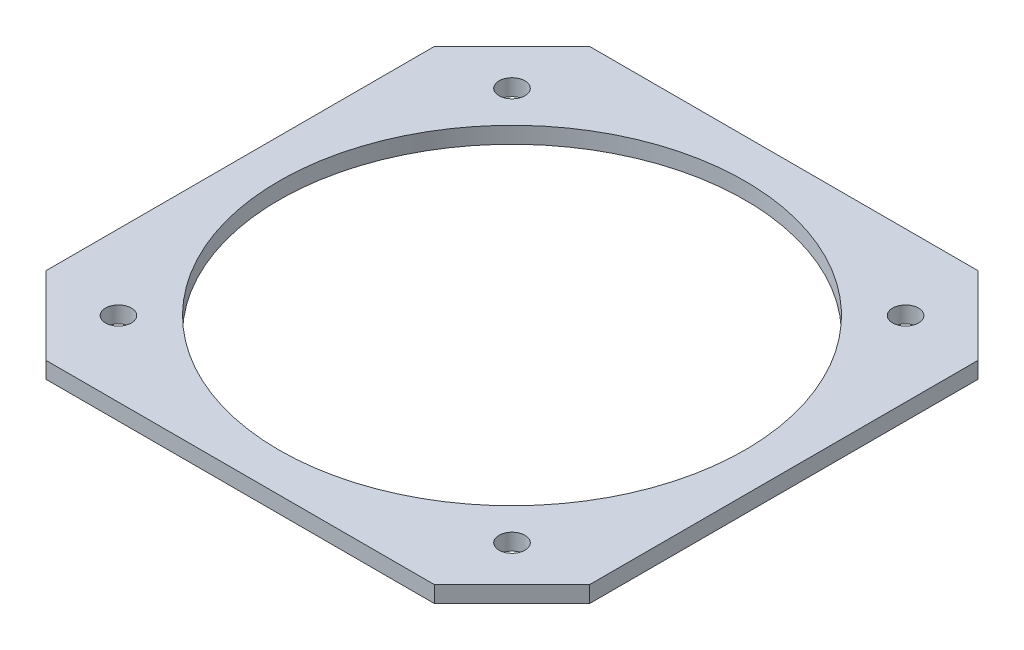
ISO-10303-21;
HEADER;
FILE_DESCRIPTION(('STEP AP214'),'2;1');
FILE_NAME('part.step','',(''),(''),'','','');
FILE_SCHEMA(('AUTOMOTIVE_DESIGN { 1 0 10303 214 1 1 1 1 }'));
ENDSEC;
DATA;
#1=APPLICATION_CONTEXT('core data for automotive mechanical design processes');
#2=APPLICATION_PROTOCOL_DEFINITION('international standard','automotive_design',2000,#1);
#3=PRODUCT_CONTEXT('',#1,'mechanical');
#4=PRODUCT('Part','Part','',(#3));
#5=PRODUCT_RELATED_PRODUCT_CATEGORY('part','',(#4));
#6=PRODUCT_DEFINITION_FORMATION('','',#4);
#7=PRODUCT_DEFINITION_CONTEXT('part definition',#1,'design');
#8=PRODUCT_DEFINITION('design','',#6,#7);
#9=PRODUCT_DEFINITION_SHAPE('','',#8);
#10=(LENGTH_UNIT() NAMED_UNIT(*) SI_UNIT(.MILLI.,.METRE.));
#11=(NAMED_UNIT(*) PLANE_ANGLE_UNIT() SI_UNIT($,.RADIAN.));
#12=(NAMED_UNIT(*) SI_UNIT($,.STERADIAN.) SOLID_ANGLE_UNIT());
#13=UNCERTAINTY_MEASURE_WITH_UNIT(LENGTH_MEASURE(1.E-05),#10,'distance_accuracy_value','');
#14=(GEOMETRIC_REPRESENTATION_CONTEXT(3) GLOBAL_UNCERTAINTY_ASSIGNED_CONTEXT((#13)) GLOBAL_UNIT_ASSIGNED_CONTEXT((#10,
#11,#12)) REPRESENTATION_CONTEXT('',''));
#15=CARTESIAN_POINT('',(0.,0.,0.));
#16=DIRECTION('',(0.,0.,1.));
#17=DIRECTION('',(1.,0.,0.));
#18=AXIS2_PLACEMENT_3D('',#15,#16,#17);
#19=CARTESIAN_POINT('',(0.,6.35,0.));
#20=DIRECTION('',(0.,1.,0.));
#21=DIRECTION('',(0.,0.,1.));
#22=AXIS2_PLACEMENT_3D('',#19,#20,#21);
#23=PLANE('',#22);
#24=CARTESIAN_POINT('',(76.0139789775539,6.35,76.0139789775538));
#25=DIRECTION('',(0.,1.,0.));
#26=DIRECTION('',(0.,0.,1.));
#27=AXIS2_PLACEMENT_3D('',#24,#25,#26);
#28=CIRCLE('',#27,5.00000000000001);
#29=CARTESIAN_POINT('',(76.0139789775539,6.35,81.0139789775538));
#30=VERTEX_POINT('',#29);
#31=EDGE_CURVE('E201',#30,#30,#28,.T.);
#32=ORIENTED_EDGE('',*,*,#31,.F.);
#33=EDGE_LOOP('',(#32));
#34=FACE_BOUND('',#33,.T.);
#35=CARTESIAN_POINT('',(-76.0139789775539,6.35,-76.0139789775538));
#36=DIRECTION('',(0.,1.,0.));
#37=DIRECTION('',(0.,0.,1.));
#38=AXIS2_PLACEMENT_3D('',#35,#36,#37);
#39=CIRCLE('',#38,5.00000000000001);
#40=CARTESIAN_POINT('',(-76.0139789775539,6.35,-71.0139789775538));
#41=VERTEX_POINT('',#40);
#42=EDGE_CURVE('E190',#41,#41,#39,.T.);
#43=ORIENTED_EDGE('',*,*,#42,.F.);
#44=EDGE_LOOP('',(#43));
#45=FACE_BOUND('',#44,.T.);
#46=DIRECTION('',(1.,0.,0.));
#47=VECTOR('',#46,1.);
#48=CARTESIAN_POINT('',(-105.,6.35,105.));
#49=LINE('',#48,#47);
#50=CARTESIAN_POINT('',(-75.,6.35,105.));
#51=VERTEX_POINT('',#50);
#52=CARTESIAN_POINT('',(74.9999999999999,6.35,105.));
#53=VERTEX_POINT('',#52);
#54=EDGE_CURVE('E145',#51,#53,#49,.T.);
#55=ORIENTED_EDGE('',*,*,#54,.T.);
#56=DIRECTION('',(-0.707106781186549,0.,0.707106781186546));
#57=VECTOR('',#56,1.);
#58=CARTESIAN_POINT('',(89.9999999999998,6.35,90.0000000000002));
#59=LINE('',#58,#57);
#60=CARTESIAN_POINT('',(105.,6.35,75.0000000000001));
#61=VERTEX_POINT('',#60);
#62=EDGE_CURVE('E164',#53,#61,#59,.F.);
#63=ORIENTED_EDGE('',*,*,#62,.T.);
#64=DIRECTION('',(0.,0.,-1.));
#65=VECTOR('',#64,1.);
#66=CARTESIAN_POINT('',(105.,6.35,-105.));
#67=LINE('',#66,#65);
#68=CARTESIAN_POINT('',(105.,6.35,-74.9999999999999));
#69=VERTEX_POINT('',#68);
#70=EDGE_CURVE('E128',#61,#69,#67,.T.);
#71=ORIENTED_EDGE('',*,*,#70,.T.);
#72=DIRECTION('',(0.707106781186546,0.,0.707106781186549));
#73=VECTOR('',#72,1.);
#74=CARTESIAN_POINT('',(90.0000000000001,6.35,-89.9999999999998));
#75=LINE('',#74,#73);
#76=CARTESIAN_POINT('',(74.9999999999999,6.35,-105.));
#77=VERTEX_POINT('',#76);
#78=EDGE_CURVE('E159',#69,#77,#75,.F.);
#79=ORIENTED_EDGE('',*,*,#78,.T.);
#80=DIRECTION('',(-1.,0.,0.));
#81=VECTOR('',#80,1.);
#82=CARTESIAN_POINT('',(-105.,6.35,-105.));
#83=LINE('',#82,#81);
#84=CARTESIAN_POINT('',(-74.9999999999999,6.35,-105.));
#85=VERTEX_POINT('',#84);
#86=EDGE_CURVE('E175',#77,#85,#83,.T.);
#87=ORIENTED_EDGE('',*,*,#86,.T.);
#88=DIRECTION('',(0.707106781186549,0.,-0.707106781186546));
#89=VECTOR('',#88,1.);
#90=CARTESIAN_POINT('',(-89.9999999999998,6.35,-90.0000000000002));
#91=LINE('',#90,#89);
#92=CARTESIAN_POINT('',(-105.,6.35,-75.0000000000001));
#93=VERTEX_POINT('',#92);
#94=EDGE_CURVE('E64',#85,#93,#91,.F.);
#95=ORIENTED_EDGE('',*,*,#94,.T.);
#96=DIRECTION('',(0.,0.,1.));
#97=VECTOR('',#96,1.);
#98=CARTESIAN_POINT('',(-105.,6.35,-105.));
#99=LINE('',#98,#97);
#100=CARTESIAN_POINT('',(-105.,6.35,74.9999999999999));
#101=VERTEX_POINT('',#100);
#102=EDGE_CURVE('E183',#93,#101,#99,.T.);
#103=ORIENTED_EDGE('',*,*,#102,.T.);
#104=DIRECTION('',(-0.707106781186546,0.,-0.707106781186549));
#105=VECTOR('',#104,1.);
#106=CARTESIAN_POINT('',(-90.0000000000001,6.35,89.9999999999998));
#107=LINE('',#106,#105);
#108=EDGE_CURVE('E162',#101,#51,#107,.F.);
#109=ORIENTED_EDGE('',*,*,#108,.T.);
#110=EDGE_LOOP('',(#55,#63,#71,#79,#87,#95,#103,#109));
#111=FACE_BOUND('',#110,.T.);
#112=CARTESIAN_POINT('',(0.,6.35,0.));
#113=DIRECTION('',(0.,1.,0.));
#114=DIRECTION('',(0.,0.,1.));
#115=AXIS2_PLACEMENT_3D('',#112,#113,#114);
#116=CIRCLE('',#115,90.);
#117=CARTESIAN_POINT('',(0.,6.35,90.));
#118=VERTEX_POINT('',#117);
#119=EDGE_CURVE('E136',#118,#118,#116,.T.);
#120=ORIENTED_EDGE('',*,*,#119,.F.);
#121=EDGE_LOOP('',(#120));
#122=FACE_BOUND('',#121,.T.);
#123=CARTESIAN_POINT('',(76.0139789775538,6.35,-76.0139789775539));
#124=DIRECTION('',(0.,1.,0.));
#125=DIRECTION('',(0.,0.,1.));
#126=AXIS2_PLACEMENT_3D('',#123,#124,#125);
#127=CIRCLE('',#126,4.99999999999999);
#128=CARTESIAN_POINT('',(76.0139789775538,6.35,-71.0139789775539));
#129=VERTEX_POINT('',#128);
#130=EDGE_CURVE('E195',#129,#129,#127,.T.);
#131=ORIENTED_EDGE('',*,*,#130,.F.);
#132=EDGE_LOOP('',(#131));
#133=FACE_BOUND('',#132,.T.);
#134=CARTESIAN_POINT('',(-76.0139789775539,6.35,76.0139789775538));
#135=DIRECTION('',(0.,1.,0.));
#136=DIRECTION('',(0.,0.,1.));
#137=AXIS2_PLACEMENT_3D('',#134,#135,#136);
#138=CIRCLE('',#137,5.00000000000001);
#139=CARTESIAN_POINT('',(-76.0139789775539,6.35,81.0139789775539));
#140=VERTEX_POINT('',#139);
#141=EDGE_CURVE('E207',#140,#140,#138,.T.);
#142=ORIENTED_EDGE('',*,*,#141,.F.);
#143=EDGE_LOOP('',(#142));
#144=FACE_BOUND('',#143,.T.);
#145=ADVANCED_FACE('F41',(#34,#45,#111,#122,#133,#144),#23,.T.);
#146=CARTESIAN_POINT('',(0.,0.,0.));
#147=DIRECTION('',(0.,1.,0.));
#148=DIRECTION('',(0.,0.,1.));
#149=AXIS2_PLACEMENT_3D('',#146,#147,#148);
#150=PLANE('',#149);
#151=DIRECTION('',(0.,0.,-1.));
#152=VECTOR('',#151,1.);
#153=CARTESIAN_POINT('',(105.,0.,-105.));
#154=LINE('',#153,#152);
#155=CARTESIAN_POINT('',(105.,0.,75.0000000000001));
#156=VERTEX_POINT('',#155);
#157=CARTESIAN_POINT('',(105.,0.,-74.9999999999999));
#158=VERTEX_POINT('',#157);
#159=EDGE_CURVE('E125',#156,#158,#154,.T.);
#160=ORIENTED_EDGE('',*,*,#159,.F.);
#161=DIRECTION('',(0.707106781186549,0.,-0.707106781186546));
#162=VECTOR('',#161,1.);
#163=CARTESIAN_POINT('',(105.,0.,75.0000000000001));
#164=LINE('',#163,#162);
#165=CARTESIAN_POINT('',(74.9999999999999,0.,105.));
#166=VERTEX_POINT('',#165);
#167=EDGE_CURVE('E108',#156,#166,#164,.F.);
#168=ORIENTED_EDGE('',*,*,#167,.T.);
#169=DIRECTION('',(1.,0.,0.));
#170=VECTOR('',#169,1.);
#171=CARTESIAN_POINT('',(-105.,0.,105.));
#172=LINE('',#171,#170);
#173=CARTESIAN_POINT('',(-75.,0.,105.));
#174=VERTEX_POINT('',#173);
#175=EDGE_CURVE('E149',#174,#166,#172,.T.);
#176=ORIENTED_EDGE('',*,*,#175,.F.);
#177=DIRECTION('',(0.707106781186546,0.,0.707106781186549));
#178=VECTOR('',#177,1.);
#179=CARTESIAN_POINT('',(-75.,0.,105.));
#180=LINE('',#179,#178);
#181=CARTESIAN_POINT('',(-105.,0.,74.9999999999999));
#182=VERTEX_POINT('',#181);
#183=EDGE_CURVE('E119',#174,#182,#180,.F.);
#184=ORIENTED_EDGE('',*,*,#183,.T.);
#185=DIRECTION('',(0.,0.,1.));
#186=VECTOR('',#185,1.);
#187=CARTESIAN_POINT('',(-105.,0.,-105.));
#188=LINE('',#187,#186);
#189=CARTESIAN_POINT('',(-105.,0.,-75.0000000000001));
#190=VERTEX_POINT('',#189);
#191=EDGE_CURVE('E139',#190,#182,#188,.T.);
#192=ORIENTED_EDGE('',*,*,#191,.F.);
#193=DIRECTION('',(-0.707106781186549,0.,0.707106781186546));
#194=VECTOR('',#193,1.);
#195=CARTESIAN_POINT('',(-105.,0.,-75.0000000000001));
#196=LINE('',#195,#194);
#197=CARTESIAN_POINT('',(-74.9999999999999,0.,-105.));
#198=VERTEX_POINT('',#197);
#199=EDGE_CURVE('E153',#190,#198,#196,.F.);
#200=ORIENTED_EDGE('',*,*,#199,.T.);
#201=DIRECTION('',(-1.,0.,0.));
#202=VECTOR('',#201,1.);
#203=CARTESIAN_POINT('',(-105.,0.,-105.));
#204=LINE('',#203,#202);
#205=CARTESIAN_POINT('',(74.9999999999999,0.,-105.));
#206=VERTEX_POINT('',#205);
#207=EDGE_CURVE('E135',#206,#198,#204,.T.);
#208=ORIENTED_EDGE('',*,*,#207,.F.);
#209=DIRECTION('',(-0.707106781186546,0.,-0.707106781186549));
#210=VECTOR('',#209,1.);
#211=CARTESIAN_POINT('',(74.9999999999999,0.,-105.));
#212=LINE('',#211,#210);
#213=EDGE_CURVE('E129',#206,#158,#212,.F.);
#214=ORIENTED_EDGE('',*,*,#213,.T.);
#215=EDGE_LOOP('',(#160,#168,#176,#184,#192,#200,#208,#214));
#216=FACE_BOUND('',#215,.T.);
#217=CARTESIAN_POINT('',(0.,0.,0.));
#218=DIRECTION('',(0.,1.,0.));
#219=DIRECTION('',(0.,0.,1.));
#220=AXIS2_PLACEMENT_3D('',#217,#218,#219);
#221=CIRCLE('',#220,90.);
#222=CARTESIAN_POINT('',(0.,0.,90.));
#223=VERTEX_POINT('',#222);
#224=EDGE_CURVE('E142',#223,#223,#221,.T.);
#225=ORIENTED_EDGE('',*,*,#224,.T.);
#226=EDGE_LOOP('',(#225));
#227=FACE_BOUND('',#226,.T.);
#228=CARTESIAN_POINT('',(-76.0139789775539,0.,-76.0139789775538));
#229=DIRECTION('',(0.,1.,0.));
#230=DIRECTION('',(0.,0.,1.));
#231=AXIS2_PLACEMENT_3D('',#228,#229,#230);
#232=CIRCLE('',#231,5.00000000000001);
#233=CARTESIAN_POINT('',(-76.0139789775539,0.,-71.0139789775538));
#234=VERTEX_POINT('',#233);
#235=EDGE_CURVE('E192',#234,#234,#232,.T.);
#236=ORIENTED_EDGE('',*,*,#235,.T.);
#237=EDGE_LOOP('',(#236));
#238=FACE_BOUND('',#237,.T.);
#239=CARTESIAN_POINT('',(76.0139789775538,0.,-76.0139789775539));
#240=DIRECTION('',(0.,1.,0.));
#241=DIRECTION('',(0.,0.,1.));
#242=AXIS2_PLACEMENT_3D('',#239,#240,#241);
#243=CIRCLE('',#242,4.99999999999999);
#244=CARTESIAN_POINT('',(76.0139789775538,0.,-71.0139789775539));
#245=VERTEX_POINT('',#244);
#246=EDGE_CURVE('E198',#245,#245,#243,.T.);
#247=ORIENTED_EDGE('',*,*,#246,.T.);
#248=EDGE_LOOP('',(#247));
#249=FACE_BOUND('',#248,.T.);
#250=CARTESIAN_POINT('',(76.0139789775539,0.,76.0139789775538));
#251=DIRECTION('',(0.,1.,0.));
#252=DIRECTION('',(0.,0.,1.));
#253=AXIS2_PLACEMENT_3D('',#250,#251,#252);
#254=CIRCLE('',#253,5.00000000000001);
#255=CARTESIAN_POINT('',(76.0139789775539,0.,81.0139789775538));
#256=VERTEX_POINT('',#255);
#257=EDGE_CURVE('E204',#256,#256,#254,.T.);
#258=ORIENTED_EDGE('',*,*,#257,.T.);
#259=EDGE_LOOP('',(#258));
#260=FACE_BOUND('',#259,.T.);
#261=CARTESIAN_POINT('',(-76.0139789775539,0.,76.0139789775538));
#262=DIRECTION('',(0.,1.,0.));
#263=DIRECTION('',(0.,0.,1.));
#264=AXIS2_PLACEMENT_3D('',#261,#262,#263);
#265=CIRCLE('',#264,5.00000000000001);
#266=CARTESIAN_POINT('',(-76.0139789775539,0.,81.0139789775539));
#267=VERTEX_POINT('',#266);
#268=EDGE_CURVE('E210',#267,#267,#265,.T.);
#269=ORIENTED_EDGE('',*,*,#268,.T.);
#270=EDGE_LOOP('',(#269));
#271=FACE_BOUND('',#270,.T.);
#272=ADVANCED_FACE('F132',(#216,#227,#238,#249,#260,#271),#150,.F.);
#273=CARTESIAN_POINT('',(105.,6.35,-105.));
#274=DIRECTION('',(-1.,0.,0.));
#275=DIRECTION('',(0.,0.,1.));
#276=AXIS2_PLACEMENT_3D('',#273,#274,#275);
#277=PLANE('',#276);
#278=ORIENTED_EDGE('',*,*,#70,.F.);
#279=DIRECTION('',(0.,-1.,0.));
#280=VECTOR('',#279,1.);
#281=CARTESIAN_POINT('',(105.,6.35,75.0000000000001));
#282=LINE('',#281,#280);
#283=EDGE_CURVE('E112',#61,#156,#282,.T.);
#284=ORIENTED_EDGE('',*,*,#283,.T.);
#285=ORIENTED_EDGE('',*,*,#159,.T.);
#286=DIRECTION('',(0.,1.,0.));
#287=VECTOR('',#286,1.);
#288=CARTESIAN_POINT('',(105.,6.35,-74.9999999999999));
#289=LINE('',#288,#287);
#290=EDGE_CURVE('E130',#158,#69,#289,.T.);
#291=ORIENTED_EDGE('',*,*,#290,.T.);
#292=EDGE_LOOP('',(#278,#284,#285,#291));
#293=FACE_BOUND('',#292,.T.);
#294=ADVANCED_FACE('F124',(#293),#277,.F.);
#295=CARTESIAN_POINT('',(-105.,6.35,-105.));
#296=DIRECTION('',(0.,0.,1.));
#297=DIRECTION('',(1.,0.,0.));
#298=AXIS2_PLACEMENT_3D('',#295,#296,#297);
#299=PLANE('',#298);
#300=ORIENTED_EDGE('',*,*,#207,.T.);
#301=DIRECTION('',(0.,1.,0.));
#302=VECTOR('',#301,1.);
#303=CARTESIAN_POINT('',(-74.9999999999999,6.35,-105.));
#304=LINE('',#303,#302);
#305=EDGE_CURVE('E11',#198,#85,#304,.T.);
#306=ORIENTED_EDGE('',*,*,#305,.T.);
#307=ORIENTED_EDGE('',*,*,#86,.F.);
#308=DIRECTION('',(0.,-1.,0.));
#309=VECTOR('',#308,1.);
#310=CARTESIAN_POINT('',(74.9999999999999,6.35,-105.));
#311=LINE('',#310,#309);
#312=EDGE_CURVE('E50',#77,#206,#311,.T.);
#313=ORIENTED_EDGE('',*,*,#312,.T.);
#314=EDGE_LOOP('',(#300,#306,#307,#313));
#315=FACE_BOUND('',#314,.T.);
#316=ADVANCED_FACE('F173',(#315),#299,.F.);
#317=CARTESIAN_POINT('',(-105.,6.35,-105.));
#318=DIRECTION('',(1.,0.,0.));
#319=DIRECTION('',(0.,0.,-1.));
#320=AXIS2_PLACEMENT_3D('',#317,#318,#319);
#321=PLANE('',#320);
#322=ORIENTED_EDGE('',*,*,#191,.T.);
#323=DIRECTION('',(0.,1.,0.));
#324=VECTOR('',#323,1.);
#325=CARTESIAN_POINT('',(-105.,6.35,74.9999999999999));
#326=LINE('',#325,#324);
#327=EDGE_CURVE('E57',#182,#101,#326,.T.);
#328=ORIENTED_EDGE('',*,*,#327,.T.);
#329=ORIENTED_EDGE('',*,*,#102,.F.);
#330=DIRECTION('',(0.,-1.,0.));
#331=VECTOR('',#330,1.);
#332=CARTESIAN_POINT('',(-105.,6.35,-75.0000000000001));
#333=LINE('',#332,#331);
#334=EDGE_CURVE('E166',#93,#190,#333,.T.);
#335=ORIENTED_EDGE('',*,*,#334,.T.);
#336=EDGE_LOOP('',(#322,#328,#329,#335));
#337=FACE_BOUND('',#336,.T.);
#338=ADVANCED_FACE('F182',(#337),#321,.F.);
#339=CARTESIAN_POINT('',(-105.,6.35,105.));
#340=DIRECTION('',(0.,0.,-1.));
#341=DIRECTION('',(-1.,0.,0.));
#342=AXIS2_PLACEMENT_3D('',#339,#340,#341);
#343=PLANE('',#342);
#344=ORIENTED_EDGE('',*,*,#175,.T.);
#345=DIRECTION('',(0.,1.,0.));
#346=VECTOR('',#345,1.);
#347=CARTESIAN_POINT('',(74.9999999999999,6.35,105.));
#348=LINE('',#347,#346);
#349=EDGE_CURVE('E113',#166,#53,#348,.T.);
#350=ORIENTED_EDGE('',*,*,#349,.T.);
#351=ORIENTED_EDGE('',*,*,#54,.F.);
#352=DIRECTION('',(0.,-1.,0.));
#353=VECTOR('',#352,1.);
#354=CARTESIAN_POINT('',(-75.,6.35,105.));
#355=LINE('',#354,#353);
#356=EDGE_CURVE('E118',#51,#174,#355,.T.);
#357=ORIENTED_EDGE('',*,*,#356,.T.);
#358=EDGE_LOOP('',(#344,#350,#351,#357));
#359=FACE_BOUND('',#358,.T.);
#360=ADVANCED_FACE('F233',(#359),#343,.F.);
#361=CARTESIAN_POINT('',(0.,6.35,0.));
#362=DIRECTION('',(0.,-1.,0.));
#363=DIRECTION('',(0.,0.,-1.));
#364=AXIS2_PLACEMENT_3D('',#361,#362,#363);
#365=CYLINDRICAL_SURFACE('',#364,90.);
#366=ORIENTED_EDGE('',*,*,#119,.T.);
#367=EDGE_LOOP('',(#366));
#368=FACE_BOUND('',#367,.T.);
#369=ORIENTED_EDGE('',*,*,#224,.F.);
#370=EDGE_LOOP('',(#369));
#371=FACE_BOUND('',#370,.T.);
#372=ADVANCED_FACE('F230',(#368,#371),#365,.F.);
#373=CARTESIAN_POINT('',(-76.0139789775539,6.35,-76.0139789775538));
#374=DIRECTION('',(0.,-1.,0.));
#375=DIRECTION('',(0.,0.,-1.));
#376=AXIS2_PLACEMENT_3D('',#373,#374,#375);
#377=CYLINDRICAL_SURFACE('',#376,5.00000000000001);
#378=ORIENTED_EDGE('',*,*,#42,.T.);
#379=EDGE_LOOP('',(#378));
#380=FACE_BOUND('',#379,.T.);
#381=ORIENTED_EDGE('',*,*,#235,.F.);
#382=EDGE_LOOP('',(#381));
#383=FACE_BOUND('',#382,.T.);
#384=ADVANCED_FACE('F274',(#380,#383),#377,.F.);
#385=CARTESIAN_POINT('',(76.0139789775538,6.35,-76.0139789775539));
#386=DIRECTION('',(0.,-1.,0.));
#387=DIRECTION('',(0.,0.,-1.));
#388=AXIS2_PLACEMENT_3D('',#385,#386,#387);
#389=CYLINDRICAL_SURFACE('',#388,4.99999999999999);
#390=ORIENTED_EDGE('',*,*,#130,.T.);
#391=EDGE_LOOP('',(#390));
#392=FACE_BOUND('',#391,.T.);
#393=ORIENTED_EDGE('',*,*,#246,.F.);
#394=EDGE_LOOP('',(#393));
#395=FACE_BOUND('',#394,.T.);
#396=ADVANCED_FACE('F270',(#392,#395),#389,.F.);
#397=CARTESIAN_POINT('',(76.0139789775539,6.35,76.0139789775538));
#398=DIRECTION('',(0.,-1.,0.));
#399=DIRECTION('',(0.,0.,-1.));
#400=AXIS2_PLACEMENT_3D('',#397,#398,#399);
#401=CYLINDRICAL_SURFACE('',#400,5.00000000000001);
#402=ORIENTED_EDGE('',*,*,#31,.T.);
#403=EDGE_LOOP('',(#402));
#404=FACE_BOUND('',#403,.T.);
#405=ORIENTED_EDGE('',*,*,#257,.F.);
#406=EDGE_LOOP('',(#405));
#407=FACE_BOUND('',#406,.T.);
#408=ADVANCED_FACE('F273',(#404,#407),#401,.F.);
#409=CARTESIAN_POINT('',(-76.0139789775539,6.35,76.0139789775538));
#410=DIRECTION('',(0.,-1.,0.));
#411=DIRECTION('',(0.,0.,-1.));
#412=AXIS2_PLACEMENT_3D('',#409,#410,#411);
#413=CYLINDRICAL_SURFACE('',#412,5.00000000000001);
#414=ORIENTED_EDGE('',*,*,#141,.T.);
#415=EDGE_LOOP('',(#414));
#416=FACE_BOUND('',#415,.T.);
#417=ORIENTED_EDGE('',*,*,#268,.F.);
#418=EDGE_LOOP('',(#417));
#419=FACE_BOUND('',#418,.T.);
#420=ADVANCED_FACE('F216',(#416,#419),#413,.F.);
#421=CARTESIAN_POINT('',(105.,6.35,75.0000000000001));
#422=DIRECTION('',(-0.707106781186546,0.,-0.707106781186549));
#423=DIRECTION('',(0.,-1.,0.));
#424=AXIS2_PLACEMENT_3D('',#421,#422,#423);
#425=PLANE('',#424);
#426=ORIENTED_EDGE('',*,*,#62,.F.);
#427=ORIENTED_EDGE('',*,*,#349,.F.);
#428=ORIENTED_EDGE('',*,*,#167,.F.);
#429=ORIENTED_EDGE('',*,*,#283,.F.);
#430=EDGE_LOOP('',(#426,#427,#428,#429));
#431=FACE_BOUND('',#430,.T.);
#432=ADVANCED_FACE('F111',(#431),#425,.F.);
#433=CARTESIAN_POINT('',(-75.,6.35,105.));
#434=DIRECTION('',(0.707106781186549,0.,-0.707106781186546));
#435=DIRECTION('',(0.,-1.,0.));
#436=AXIS2_PLACEMENT_3D('',#433,#434,#435);
#437=PLANE('',#436);
#438=ORIENTED_EDGE('',*,*,#108,.F.);
#439=ORIENTED_EDGE('',*,*,#327,.F.);
#440=ORIENTED_EDGE('',*,*,#183,.F.);
#441=ORIENTED_EDGE('',*,*,#356,.F.);
#442=EDGE_LOOP('',(#438,#439,#440,#441));
#443=FACE_BOUND('',#442,.T.);
#444=ADVANCED_FACE('F249',(#443),#437,.F.);
#445=CARTESIAN_POINT('',(-105.,6.35,-75.0000000000001));
#446=DIRECTION('',(0.707106781186546,0.,0.707106781186549));
#447=DIRECTION('',(0.,-1.,0.));
#448=AXIS2_PLACEMENT_3D('',#445,#446,#447);
#449=PLANE('',#448);
#450=ORIENTED_EDGE('',*,*,#94,.F.);
#451=ORIENTED_EDGE('',*,*,#305,.F.);
#452=ORIENTED_EDGE('',*,*,#199,.F.);
#453=ORIENTED_EDGE('',*,*,#334,.F.);
#454=EDGE_LOOP('',(#450,#451,#452,#453));
#455=FACE_BOUND('',#454,.T.);
#456=ADVANCED_FACE('F181',(#455),#449,.F.);
#457=CARTESIAN_POINT('',(74.9999999999999,6.35,-105.));
#458=DIRECTION('',(-0.707106781186549,0.,0.707106781186546));
#459=DIRECTION('',(0.,-1.,0.));
#460=AXIS2_PLACEMENT_3D('',#457,#458,#459);
#461=PLANE('',#460);
#462=ORIENTED_EDGE('',*,*,#78,.F.);
#463=ORIENTED_EDGE('',*,*,#290,.F.);
#464=ORIENTED_EDGE('',*,*,#213,.F.);
#465=ORIENTED_EDGE('',*,*,#312,.F.);
#466=EDGE_LOOP('',(#462,#463,#464,#465));
#467=FACE_BOUND('',#466,.T.);
#468=ADVANCED_FACE('F44',(#467),#461,.F.);
#469=CLOSED_SHELL('',(#145,#272,#294,#316,#338,#360,#372,#384,#396,#408,#420,#432,#444,#456,#468));
#470=MANIFOLD_SOLID_BREP('B2',#469);
#471=ADVANCED_BREP_SHAPE_REPRESENTATION('',(#18,#470),#14);
#472=SHAPE_DEFINITION_REPRESENTATION(#9,#471);
ENDSEC;
END-ISO-10303-21;
